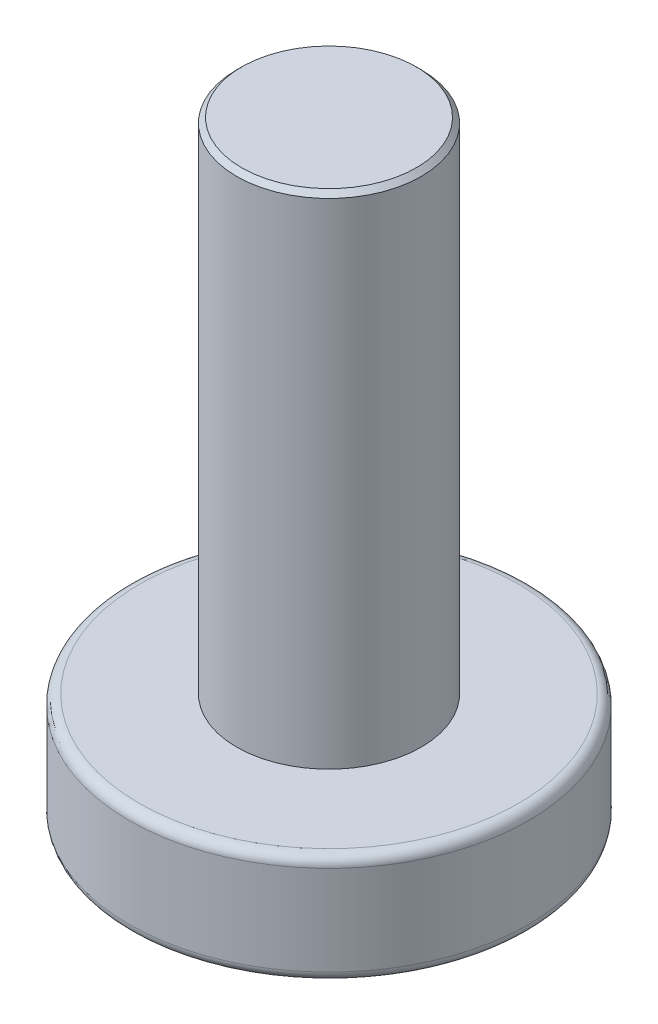
ISO-10303-21;
HEADER;
FILE_DESCRIPTION(('STEP AP214'),'2;1');
FILE_NAME('part.step','',(''),(''),'','','');
FILE_SCHEMA(('AUTOMOTIVE_DESIGN { 1 0 10303 214 1 1 1 1 }'));
ENDSEC;
DATA;
#1=APPLICATION_CONTEXT('core data for automotive mechanical design processes');
#2=APPLICATION_PROTOCOL_DEFINITION('international standard','automotive_design',2000,#1);
#3=PRODUCT_CONTEXT('',#1,'mechanical');
#4=PRODUCT('Part','Part','',(#3));
#5=PRODUCT_RELATED_PRODUCT_CATEGORY('part','',(#4));
#6=PRODUCT_DEFINITION_FORMATION('','',#4);
#7=PRODUCT_DEFINITION_CONTEXT('part definition',#1,'design');
#8=PRODUCT_DEFINITION('design','',#6,#7);
#9=PRODUCT_DEFINITION_SHAPE('','',#8);
#10=(LENGTH_UNIT() NAMED_UNIT(*) SI_UNIT(.MILLI.,.METRE.));
#11=(NAMED_UNIT(*) PLANE_ANGLE_UNIT() SI_UNIT($,.RADIAN.));
#12=(NAMED_UNIT(*) SI_UNIT($,.STERADIAN.) SOLID_ANGLE_UNIT());
#13=UNCERTAINTY_MEASURE_WITH_UNIT(LENGTH_MEASURE(1.E-05),#10,'distance_accuracy_value','');
#14=(GEOMETRIC_REPRESENTATION_CONTEXT(3) GLOBAL_UNCERTAINTY_ASSIGNED_CONTEXT((#13)) GLOBAL_UNIT_ASSIGNED_CONTEXT((#10,
#11,#12)) REPRESENTATION_CONTEXT('',''));
#15=CARTESIAN_POINT('',(0.,0.,0.));
#16=DIRECTION('',(0.,0.,1.));
#17=DIRECTION('',(1.,0.,0.));
#18=AXIS2_PLACEMENT_3D('',#15,#16,#17);
#19=CARTESIAN_POINT('',(0.,2.2,0.));
#20=DIRECTION('',(0.,-1.,0.));
#21=DIRECTION('',(0.,0.,-1.));
#22=AXIS2_PLACEMENT_3D('',#19,#20,#21);
#23=CYLINDRICAL_SURFACE('',#22,4.);
#24=CARTESIAN_POINT('',(0.,2.,0.));
#25=DIRECTION('',(0.,1.,0.));
#26=DIRECTION('',(0.,0.,1.));
#27=AXIS2_PLACEMENT_3D('',#24,#25,#26);
#28=CIRCLE('',#27,4.);
#29=CARTESIAN_POINT('',(0.,2.,4.));
#30=VERTEX_POINT('',#29);
#31=EDGE_CURVE('E43',#30,#30,#28,.F.);
#32=ORIENTED_EDGE('',*,*,#31,.T.);
#33=EDGE_LOOP('',(#32));
#34=FACE_BOUND('',#33,.T.);
#35=CARTESIAN_POINT('',(0.,0.2,0.));
#36=DIRECTION('',(0.,1.,0.));
#37=DIRECTION('',(0.,0.,1.));
#38=AXIS2_PLACEMENT_3D('',#35,#36,#37);
#39=CIRCLE('',#38,4.);
#40=CARTESIAN_POINT('',(0.,0.2,4.));
#41=VERTEX_POINT('',#40);
#42=EDGE_CURVE('E220',#41,#41,#39,.T.);
#43=ORIENTED_EDGE('',*,*,#42,.T.);
#44=EDGE_LOOP('',(#43));
#45=FACE_BOUND('',#44,.T.);
#46=ADVANCED_FACE('F35',(#34,#45),#23,.T.);
#47=CARTESIAN_POINT('',(0.,2.2,0.));
#48=DIRECTION('',(0.,1.,0.));
#49=DIRECTION('',(0.,0.,1.));
#50=AXIS2_PLACEMENT_3D('',#47,#48,#49);
#51=PLANE('',#50);
#52=CARTESIAN_POINT('',(0.,2.2,0.));
#53=DIRECTION('',(0.,1.,0.));
#54=DIRECTION('',(0.,0.,1.));
#55=AXIS2_PLACEMENT_3D('',#52,#53,#54);
#56=CIRCLE('',#55,3.8);
#57=CARTESIAN_POINT('',(0.,2.2,3.8));
#58=VERTEX_POINT('',#57);
#59=EDGE_CURVE('E217',#58,#58,#56,.T.);
#60=ORIENTED_EDGE('',*,*,#59,.T.);
#61=EDGE_LOOP('',(#60));
#62=FACE_BOUND('',#61,.T.);
#63=CARTESIAN_POINT('',(0.,2.2,0.));
#64=DIRECTION('',(0.,1.,0.));
#65=DIRECTION('',(0.,0.,1.));
#66=AXIS2_PLACEMENT_3D('',#63,#64,#65);
#67=CIRCLE('',#66,1.85);
#68=CARTESIAN_POINT('',(0.,2.2,1.85));
#69=VERTEX_POINT('',#68);
#70=EDGE_CURVE('E191',#69,#69,#67,.T.);
#71=ORIENTED_EDGE('',*,*,#70,.F.);
#72=EDGE_LOOP('',(#71));
#73=FACE_BOUND('',#72,.T.);
#74=ADVANCED_FACE('F233',(#62,#73),#51,.T.);
#75=CARTESIAN_POINT('',(0.,0.,0.));
#76=DIRECTION('',(0.,1.,0.));
#77=DIRECTION('',(0.,0.,1.));
#78=AXIS2_PLACEMENT_3D('',#75,#76,#77);
#79=PLANE('',#78);
#80=DIRECTION('',(0.,0.,-1.));
#81=VECTOR('',#80,1.);
#82=CARTESIAN_POINT('',(-2.,0.,-0.5));
#83=LINE('',#82,#81);
#84=CARTESIAN_POINT('',(-2.,0.,0.5));
#85=VERTEX_POINT('',#84);
#86=CARTESIAN_POINT('',(-2.,0.,-0.5));
#87=VERTEX_POINT('',#86);
#88=EDGE_CURVE('E160',#85,#87,#83,.T.);
#89=ORIENTED_EDGE('',*,*,#88,.F.);
#90=DIRECTION('',(-1.,0.,0.));
#91=VECTOR('',#90,1.);
#92=CARTESIAN_POINT('',(-2.,0.,0.5));
#93=LINE('',#92,#91);
#94=CARTESIAN_POINT('',(-0.5,0.,0.5));
#95=VERTEX_POINT('',#94);
#96=EDGE_CURVE('E50',#95,#85,#93,.T.);
#97=ORIENTED_EDGE('',*,*,#96,.F.);
#98=DIRECTION('',(0.,0.,-1.));
#99=VECTOR('',#98,1.);
#100=CARTESIAN_POINT('',(-0.5,0.,0.5));
#101=LINE('',#100,#99);
#102=CARTESIAN_POINT('',(-0.5,0.,2.));
#103=VERTEX_POINT('',#102);
#104=EDGE_CURVE('E187',#103,#95,#101,.T.);
#105=ORIENTED_EDGE('',*,*,#104,.F.);
#106=DIRECTION('',(-1.,0.,0.));
#107=VECTOR('',#106,1.);
#108=CARTESIAN_POINT('',(-0.5,0.,2.));
#109=LINE('',#108,#107);
#110=CARTESIAN_POINT('',(0.5,0.,2.));
#111=VERTEX_POINT('',#110);
#112=EDGE_CURVE('E185',#111,#103,#109,.T.);
#113=ORIENTED_EDGE('',*,*,#112,.F.);
#114=DIRECTION('',(0.,0.,1.));
#115=VECTOR('',#114,1.);
#116=CARTESIAN_POINT('',(0.5,0.,2.));
#117=LINE('',#116,#115);
#118=CARTESIAN_POINT('',(0.5,0.,0.5));
#119=VERTEX_POINT('',#118);
#120=EDGE_CURVE('E134',#119,#111,#117,.T.);
#121=ORIENTED_EDGE('',*,*,#120,.F.);
#122=DIRECTION('',(-1.,0.,0.));
#123=VECTOR('',#122,1.);
#124=CARTESIAN_POINT('',(0.5,0.,0.5));
#125=LINE('',#124,#123);
#126=CARTESIAN_POINT('',(2.,0.,0.5));
#127=VERTEX_POINT('',#126);
#128=EDGE_CURVE('E181',#127,#119,#125,.T.);
#129=ORIENTED_EDGE('',*,*,#128,.F.);
#130=DIRECTION('',(0.,0.,1.));
#131=VECTOR('',#130,1.);
#132=CARTESIAN_POINT('',(2.,0.,0.5));
#133=LINE('',#132,#131);
#134=CARTESIAN_POINT('',(2.,0.,-0.5));
#135=VERTEX_POINT('',#134);
#136=EDGE_CURVE('E178',#135,#127,#133,.T.);
#137=ORIENTED_EDGE('',*,*,#136,.F.);
#138=DIRECTION('',(1.,0.,0.));
#139=VECTOR('',#138,1.);
#140=CARTESIAN_POINT('',(2.,0.,-0.5));
#141=LINE('',#140,#139);
#142=CARTESIAN_POINT('',(0.5,0.,-0.5));
#143=VERTEX_POINT('',#142);
#144=EDGE_CURVE('E175',#143,#135,#141,.T.);
#145=ORIENTED_EDGE('',*,*,#144,.F.);
#146=DIRECTION('',(0.,0.,1.));
#147=VECTOR('',#146,1.);
#148=CARTESIAN_POINT('',(0.5,0.,-0.5));
#149=LINE('',#148,#147);
#150=CARTESIAN_POINT('',(0.5,0.,-2.));
#151=VERTEX_POINT('',#150);
#152=EDGE_CURVE('E172',#151,#143,#149,.T.);
#153=ORIENTED_EDGE('',*,*,#152,.F.);
#154=DIRECTION('',(1.,0.,0.));
#155=VECTOR('',#154,1.);
#156=CARTESIAN_POINT('',(0.5,0.,-2.));
#157=LINE('',#156,#155);
#158=CARTESIAN_POINT('',(-0.5,0.,-2.));
#159=VERTEX_POINT('',#158);
#160=EDGE_CURVE('E169',#159,#151,#157,.T.);
#161=ORIENTED_EDGE('',*,*,#160,.F.);
#162=DIRECTION('',(0.,0.,-1.));
#163=VECTOR('',#162,1.);
#164=CARTESIAN_POINT('',(-0.5,0.,-2.));
#165=LINE('',#164,#163);
#166=CARTESIAN_POINT('',(-0.5,0.,-0.5));
#167=VERTEX_POINT('',#166);
#168=EDGE_CURVE('E166',#167,#159,#165,.T.);
#169=ORIENTED_EDGE('',*,*,#168,.F.);
#170=DIRECTION('',(1.,0.,0.));
#171=VECTOR('',#170,1.);
#172=CARTESIAN_POINT('',(-0.5,0.,-0.5));
#173=LINE('',#172,#171);
#174=EDGE_CURVE('E163',#87,#167,#173,.T.);
#175=ORIENTED_EDGE('',*,*,#174,.F.);
#176=EDGE_LOOP('',(#89,#97,#105,#113,#121,#129,#137,#145,#153,#161,#169,#175));
#177=FACE_BOUND('',#176,.T.);
#178=CARTESIAN_POINT('',(0.,0.,0.));
#179=DIRECTION('',(0.,1.,0.));
#180=DIRECTION('',(0.,0.,1.));
#181=AXIS2_PLACEMENT_3D('',#178,#179,#180);
#182=CIRCLE('',#181,3.8);
#183=CARTESIAN_POINT('',(0.,0.,3.8));
#184=VERTEX_POINT('',#183);
#185=EDGE_CURVE('E11',#184,#184,#182,.F.);
#186=ORIENTED_EDGE('',*,*,#185,.T.);
#187=EDGE_LOOP('',(#186));
#188=FACE_BOUND('',#187,.T.);
#189=ADVANCED_FACE('F236',(#177,#188),#79,.F.);
#190=CARTESIAN_POINT('',(0.,12.2,0.));
#191=DIRECTION('',(0.,-1.,0.));
#192=DIRECTION('',(0.,0.,-1.));
#193=AXIS2_PLACEMENT_3D('',#190,#191,#192);
#194=CYLINDRICAL_SURFACE('',#193,1.85);
#195=CARTESIAN_POINT('',(0.,12.1,0.));
#196=DIRECTION('',(0.,1.,0.));
#197=DIRECTION('',(0.,0.,1.));
#198=AXIS2_PLACEMENT_3D('',#195,#196,#197);
#199=CIRCLE('',#198,1.85);
#200=CARTESIAN_POINT('',(0.,12.1,1.85));
#201=VERTEX_POINT('',#200);
#202=EDGE_CURVE('E214',#201,#201,#199,.F.);
#203=ORIENTED_EDGE('',*,*,#202,.T.);
#204=EDGE_LOOP('',(#203));
#205=FACE_BOUND('',#204,.T.);
#206=ORIENTED_EDGE('',*,*,#70,.T.);
#207=EDGE_LOOP('',(#206));
#208=FACE_BOUND('',#207,.T.);
#209=ADVANCED_FACE('F240',(#205,#208),#194,.T.);
#210=CARTESIAN_POINT('',(0.,12.2,0.));
#211=DIRECTION('',(0.,1.,0.));
#212=DIRECTION('',(0.,0.,1.));
#213=AXIS2_PLACEMENT_3D('',#210,#211,#212);
#214=PLANE('',#213);
#215=CARTESIAN_POINT('',(0.,12.2,0.));
#216=DIRECTION('',(0.,1.,0.));
#217=DIRECTION('',(0.,0.,1.));
#218=AXIS2_PLACEMENT_3D('',#215,#216,#217);
#219=CIRCLE('',#218,1.75);
#220=CARTESIAN_POINT('',(0.,12.2,1.75));
#221=VERTEX_POINT('',#220);
#222=EDGE_CURVE('E211',#221,#221,#219,.T.);
#223=ORIENTED_EDGE('',*,*,#222,.T.);
#224=EDGE_LOOP('',(#223));
#225=FACE_BOUND('',#224,.T.);
#226=ADVANCED_FACE('F242',(#225),#214,.T.);
#227=CARTESIAN_POINT('',(0.,12.2,0.));
#228=DIRECTION('',(0.,-1.,0.));
#229=DIRECTION('',(0.,0.,-1.));
#230=AXIS2_PLACEMENT_3D('',#227,#228,#229);
#231=CONICAL_SURFACE('',#230,1.75,0.785398163397453);
#232=ORIENTED_EDGE('',*,*,#202,.F.);
#233=EDGE_LOOP('',(#232));
#234=FACE_BOUND('',#233,.T.);
#235=ORIENTED_EDGE('',*,*,#222,.F.);
#236=EDGE_LOOP('',(#235));
#237=FACE_BOUND('',#236,.T.);
#238=ADVANCED_FACE('F230',(#234,#237),#231,.T.);
#239=CARTESIAN_POINT('',(0.,2.,0.));
#240=DIRECTION('',(0.,1.,0.));
#241=DIRECTION('',(0.,0.,1.));
#242=AXIS2_PLACEMENT_3D('',#239,#240,#241);
#243=TOROIDAL_SURFACE('',#242,3.8,0.2);
#244=ORIENTED_EDGE('',*,*,#31,.F.);
#245=EDGE_LOOP('',(#244));
#246=FACE_BOUND('',#245,.T.);
#247=ORIENTED_EDGE('',*,*,#59,.F.);
#248=EDGE_LOOP('',(#247));
#249=FACE_BOUND('',#248,.T.);
#250=ADVANCED_FACE('F227',(#246,#249),#243,.T.);
#251=CARTESIAN_POINT('',(0.,0.2,0.));
#252=DIRECTION('',(0.,1.,0.));
#253=DIRECTION('',(0.,0.,1.));
#254=AXIS2_PLACEMENT_3D('',#251,#252,#253);
#255=TOROIDAL_SURFACE('',#254,3.8,0.2);
#256=ORIENTED_EDGE('',*,*,#185,.F.);
#257=EDGE_LOOP('',(#256));
#258=FACE_BOUND('',#257,.T.);
#259=ORIENTED_EDGE('',*,*,#42,.F.);
#260=EDGE_LOOP('',(#259));
#261=FACE_BOUND('',#260,.T.);
#262=ADVANCED_FACE('F37',(#258,#261),#255,.T.);
#263=CARTESIAN_POINT('',(-2.,1.5,0.5));
#264=DIRECTION('',(0.,0.,1.));
#265=DIRECTION('',(1.,0.,0.));
#266=AXIS2_PLACEMENT_3D('',#263,#264,#265);
#267=PLANE('',#266);
#268=ORIENTED_EDGE('',*,*,#96,.T.);
#269=DIRECTION('',(0.,-1.,0.));
#270=VECTOR('',#269,1.);
#271=CARTESIAN_POINT('',(-2.,1.5,0.5));
#272=LINE('',#271,#270);
#273=CARTESIAN_POINT('',(-2.,1.5,0.5));
#274=VERTEX_POINT('',#273);
#275=EDGE_CURVE('E98',#274,#85,#272,.T.);
#276=ORIENTED_EDGE('',*,*,#275,.F.);
#277=DIRECTION('',(-1.,0.,0.));
#278=VECTOR('',#277,1.);
#279=CARTESIAN_POINT('',(-2.,1.5,0.5));
#280=LINE('',#279,#278);
#281=CARTESIAN_POINT('',(-0.5,1.5,0.5));
#282=VERTEX_POINT('',#281);
#283=EDGE_CURVE('E189',#282,#274,#280,.T.);
#284=ORIENTED_EDGE('',*,*,#283,.F.);
#285=DIRECTION('',(0.,-1.,0.));
#286=VECTOR('',#285,1.);
#287=CARTESIAN_POINT('',(-0.5,1.5,0.5));
#288=LINE('',#287,#286);
#289=EDGE_CURVE('E58',#282,#95,#288,.T.);
#290=ORIENTED_EDGE('',*,*,#289,.T.);
#291=EDGE_LOOP('',(#268,#276,#284,#290));
#292=FACE_BOUND('',#291,.T.);
#293=ADVANCED_FACE('F278',(#292),#267,.F.);
#294=CARTESIAN_POINT('',(-0.5,1.5,0.5));
#295=DIRECTION('',(-1.,0.,0.));
#296=DIRECTION('',(0.,0.,1.));
#297=AXIS2_PLACEMENT_3D('',#294,#295,#296);
#298=PLANE('',#297);
#299=ORIENTED_EDGE('',*,*,#104,.T.);
#300=ORIENTED_EDGE('',*,*,#289,.F.);
#301=DIRECTION('',(0.,0.,-1.));
#302=VECTOR('',#301,1.);
#303=CARTESIAN_POINT('',(-0.5,1.5,0.5));
#304=LINE('',#303,#302);
#305=CARTESIAN_POINT('',(-0.5,1.5,2.));
#306=VERTEX_POINT('',#305);
#307=EDGE_CURVE('E146',#306,#282,#304,.T.);
#308=ORIENTED_EDGE('',*,*,#307,.F.);
#309=DIRECTION('',(0.,-1.,0.));
#310=VECTOR('',#309,1.);
#311=CARTESIAN_POINT('',(-0.5,1.5,2.));
#312=LINE('',#311,#310);
#313=EDGE_CURVE('E138',#306,#103,#312,.T.);
#314=ORIENTED_EDGE('',*,*,#313,.T.);
#315=EDGE_LOOP('',(#299,#300,#308,#314));
#316=FACE_BOUND('',#315,.T.);
#317=ADVANCED_FACE('F286',(#316),#298,.F.);
#318=CARTESIAN_POINT('',(-0.5,1.5,2.));
#319=DIRECTION('',(0.,0.,1.));
#320=DIRECTION('',(1.,0.,0.));
#321=AXIS2_PLACEMENT_3D('',#318,#319,#320);
#322=PLANE('',#321);
#323=ORIENTED_EDGE('',*,*,#112,.T.);
#324=ORIENTED_EDGE('',*,*,#313,.F.);
#325=DIRECTION('',(-1.,0.,0.));
#326=VECTOR('',#325,1.);
#327=CARTESIAN_POINT('',(-0.5,1.5,2.));
#328=LINE('',#327,#326);
#329=CARTESIAN_POINT('',(0.5,1.5,2.));
#330=VERTEX_POINT('',#329);
#331=EDGE_CURVE('E142',#330,#306,#328,.T.);
#332=ORIENTED_EDGE('',*,*,#331,.F.);
#333=DIRECTION('',(0.,-1.,0.));
#334=VECTOR('',#333,1.);
#335=CARTESIAN_POINT('',(0.5,1.5,2.));
#336=LINE('',#335,#334);
#337=EDGE_CURVE('E127',#330,#111,#336,.T.);
#338=ORIENTED_EDGE('',*,*,#337,.T.);
#339=EDGE_LOOP('',(#323,#324,#332,#338));
#340=FACE_BOUND('',#339,.T.);
#341=ADVANCED_FACE('F143',(#340),#322,.F.);
#342=CARTESIAN_POINT('',(0.5,1.5,2.));
#343=DIRECTION('',(1.,0.,0.));
#344=DIRECTION('',(0.,0.,-1.));
#345=AXIS2_PLACEMENT_3D('',#342,#343,#344);
#346=PLANE('',#345);
#347=ORIENTED_EDGE('',*,*,#120,.T.);
#348=ORIENTED_EDGE('',*,*,#337,.F.);
#349=DIRECTION('',(0.,0.,1.));
#350=VECTOR('',#349,1.);
#351=CARTESIAN_POINT('',(0.5,1.5,2.));
#352=LINE('',#351,#350);
#353=CARTESIAN_POINT('',(0.5,1.5,0.5));
#354=VERTEX_POINT('',#353);
#355=EDGE_CURVE('E131',#354,#330,#352,.T.);
#356=ORIENTED_EDGE('',*,*,#355,.F.);
#357=DIRECTION('',(0.,-1.,0.));
#358=VECTOR('',#357,1.);
#359=CARTESIAN_POINT('',(0.5,1.5,0.5));
#360=LINE('',#359,#358);
#361=EDGE_CURVE('E139',#354,#119,#360,.T.);
#362=ORIENTED_EDGE('',*,*,#361,.T.);
#363=EDGE_LOOP('',(#347,#348,#356,#362));
#364=FACE_BOUND('',#363,.T.);
#365=ADVANCED_FACE('F129',(#364),#346,.F.);
#366=CARTESIAN_POINT('',(0.5,1.5,0.5));
#367=DIRECTION('',(0.,0.,1.));
#368=DIRECTION('',(1.,0.,0.));
#369=AXIS2_PLACEMENT_3D('',#366,#367,#368);
#370=PLANE('',#369);
#371=ORIENTED_EDGE('',*,*,#128,.T.);
#372=ORIENTED_EDGE('',*,*,#361,.F.);
#373=DIRECTION('',(-1.,0.,0.));
#374=VECTOR('',#373,1.);
#375=CARTESIAN_POINT('',(0.5,1.5,0.5));
#376=LINE('',#375,#374);
#377=CARTESIAN_POINT('',(2.,1.5,0.5));
#378=VERTEX_POINT('',#377);
#379=EDGE_CURVE('E152',#378,#354,#376,.T.);
#380=ORIENTED_EDGE('',*,*,#379,.F.);
#381=DIRECTION('',(0.,-1.,0.));
#382=VECTOR('',#381,1.);
#383=CARTESIAN_POINT('',(2.,1.5,0.5));
#384=LINE('',#383,#382);
#385=EDGE_CURVE('E194',#378,#127,#384,.T.);
#386=ORIENTED_EDGE('',*,*,#385,.T.);
#387=EDGE_LOOP('',(#371,#372,#380,#386));
#388=FACE_BOUND('',#387,.T.);
#389=ADVANCED_FACE('F305',(#388),#370,.F.);
#390=CARTESIAN_POINT('',(2.,1.5,0.5));
#391=DIRECTION('',(1.,0.,0.));
#392=DIRECTION('',(0.,0.,-1.));
#393=AXIS2_PLACEMENT_3D('',#390,#391,#392);
#394=PLANE('',#393);
#395=ORIENTED_EDGE('',*,*,#136,.T.);
#396=ORIENTED_EDGE('',*,*,#385,.F.);
#397=DIRECTION('',(0.,0.,1.));
#398=VECTOR('',#397,1.);
#399=CARTESIAN_POINT('',(2.,1.5,0.5));
#400=LINE('',#399,#398);
#401=CARTESIAN_POINT('',(2.,1.5,-0.5));
#402=VERTEX_POINT('',#401);
#403=EDGE_CURVE('E154',#402,#378,#400,.T.);
#404=ORIENTED_EDGE('',*,*,#403,.F.);
#405=DIRECTION('',(0.,-1.,0.));
#406=VECTOR('',#405,1.);
#407=CARTESIAN_POINT('',(2.,1.5,-0.5));
#408=LINE('',#407,#406);
#409=EDGE_CURVE('E196',#402,#135,#408,.T.);
#410=ORIENTED_EDGE('',*,*,#409,.T.);
#411=EDGE_LOOP('',(#395,#396,#404,#410));
#412=FACE_BOUND('',#411,.T.);
#413=ADVANCED_FACE('F312',(#412),#394,.F.);
#414=CARTESIAN_POINT('',(2.,1.5,-0.5));
#415=DIRECTION('',(0.,0.,-1.));
#416=DIRECTION('',(-1.,0.,0.));
#417=AXIS2_PLACEMENT_3D('',#414,#415,#416);
#418=PLANE('',#417);
#419=ORIENTED_EDGE('',*,*,#144,.T.);
#420=ORIENTED_EDGE('',*,*,#409,.F.);
#421=DIRECTION('',(1.,0.,0.));
#422=VECTOR('',#421,1.);
#423=CARTESIAN_POINT('',(2.,1.5,-0.5));
#424=LINE('',#423,#422);
#425=CARTESIAN_POINT('',(0.5,1.5,-0.5));
#426=VERTEX_POINT('',#425);
#427=EDGE_CURVE('E455',#426,#402,#424,.T.);
#428=ORIENTED_EDGE('',*,*,#427,.F.);
#429=DIRECTION('',(0.,-1.,0.));
#430=VECTOR('',#429,1.);
#431=CARTESIAN_POINT('',(0.5,1.5,-0.5));
#432=LINE('',#431,#430);
#433=EDGE_CURVE('E198',#426,#143,#432,.T.);
#434=ORIENTED_EDGE('',*,*,#433,.T.);
#435=EDGE_LOOP('',(#419,#420,#428,#434));
#436=FACE_BOUND('',#435,.T.);
#437=ADVANCED_FACE('F320',(#436),#418,.F.);
#438=CARTESIAN_POINT('',(0.5,1.5,-0.5));
#439=DIRECTION('',(1.,0.,0.));
#440=DIRECTION('',(0.,0.,-1.));
#441=AXIS2_PLACEMENT_3D('',#438,#439,#440);
#442=PLANE('',#441);
#443=ORIENTED_EDGE('',*,*,#152,.T.);
#444=ORIENTED_EDGE('',*,*,#433,.F.);
#445=DIRECTION('',(0.,0.,1.));
#446=VECTOR('',#445,1.);
#447=CARTESIAN_POINT('',(0.5,1.5,-0.5));
#448=LINE('',#447,#446);
#449=CARTESIAN_POINT('',(0.5,1.5,-2.));
#450=VERTEX_POINT('',#449);
#451=EDGE_CURVE('E452',#450,#426,#448,.T.);
#452=ORIENTED_EDGE('',*,*,#451,.F.);
#453=DIRECTION('',(0.,-1.,0.));
#454=VECTOR('',#453,1.);
#455=CARTESIAN_POINT('',(0.5,1.5,-2.));
#456=LINE('',#455,#454);
#457=EDGE_CURVE('E200',#450,#151,#456,.T.);
#458=ORIENTED_EDGE('',*,*,#457,.T.);
#459=EDGE_LOOP('',(#443,#444,#452,#458));
#460=FACE_BOUND('',#459,.T.);
#461=ADVANCED_FACE('F328',(#460),#442,.F.);
#462=CARTESIAN_POINT('',(0.5,1.5,-2.));
#463=DIRECTION('',(0.,0.,-1.));
#464=DIRECTION('',(-1.,0.,0.));
#465=AXIS2_PLACEMENT_3D('',#462,#463,#464);
#466=PLANE('',#465);
#467=ORIENTED_EDGE('',*,*,#160,.T.);
#468=ORIENTED_EDGE('',*,*,#457,.F.);
#469=DIRECTION('',(1.,0.,0.));
#470=VECTOR('',#469,1.);
#471=CARTESIAN_POINT('',(0.5,1.5,-2.));
#472=LINE('',#471,#470);
#473=CARTESIAN_POINT('',(-0.5,1.5,-2.));
#474=VERTEX_POINT('',#473);
#475=EDGE_CURVE('E449',#474,#450,#472,.T.);
#476=ORIENTED_EDGE('',*,*,#475,.F.);
#477=DIRECTION('',(0.,-1.,0.));
#478=VECTOR('',#477,1.);
#479=CARTESIAN_POINT('',(-0.5,1.5,-2.));
#480=LINE('',#479,#478);
#481=EDGE_CURVE('E202',#474,#159,#480,.T.);
#482=ORIENTED_EDGE('',*,*,#481,.T.);
#483=EDGE_LOOP('',(#467,#468,#476,#482));
#484=FACE_BOUND('',#483,.T.);
#485=ADVANCED_FACE('F336',(#484),#466,.F.);
#486=CARTESIAN_POINT('',(-0.5,1.5,-2.));
#487=DIRECTION('',(-1.,0.,0.));
#488=DIRECTION('',(0.,0.,1.));
#489=AXIS2_PLACEMENT_3D('',#486,#487,#488);
#490=PLANE('',#489);
#491=ORIENTED_EDGE('',*,*,#168,.T.);
#492=ORIENTED_EDGE('',*,*,#481,.F.);
#493=DIRECTION('',(0.,0.,-1.));
#494=VECTOR('',#493,1.);
#495=CARTESIAN_POINT('',(-0.5,1.5,-2.));
#496=LINE('',#495,#494);
#497=CARTESIAN_POINT('',(-0.5,1.5,-0.5));
#498=VERTEX_POINT('',#497);
#499=EDGE_CURVE('E442',#498,#474,#496,.T.);
#500=ORIENTED_EDGE('',*,*,#499,.F.);
#501=DIRECTION('',(0.,-1.,0.));
#502=VECTOR('',#501,1.);
#503=CARTESIAN_POINT('',(-0.5,1.5,-0.5));
#504=LINE('',#503,#502);
#505=EDGE_CURVE('E204',#498,#167,#504,.T.);
#506=ORIENTED_EDGE('',*,*,#505,.T.);
#507=EDGE_LOOP('',(#491,#492,#500,#506));
#508=FACE_BOUND('',#507,.T.);
#509=ADVANCED_FACE('F344',(#508),#490,.F.);
#510=CARTESIAN_POINT('',(-0.5,1.5,-0.5));
#511=DIRECTION('',(0.,0.,-1.));
#512=DIRECTION('',(-1.,0.,0.));
#513=AXIS2_PLACEMENT_3D('',#510,#511,#512);
#514=PLANE('',#513);
#515=ORIENTED_EDGE('',*,*,#174,.T.);
#516=ORIENTED_EDGE('',*,*,#505,.F.);
#517=DIRECTION('',(1.,0.,0.));
#518=VECTOR('',#517,1.);
#519=CARTESIAN_POINT('',(-0.5,1.5,-0.5));
#520=LINE('',#519,#518);
#521=CARTESIAN_POINT('',(-2.,1.5,-0.5));
#522=VERTEX_POINT('',#521);
#523=EDGE_CURVE('E439',#522,#498,#520,.T.);
#524=ORIENTED_EDGE('',*,*,#523,.F.);
#525=DIRECTION('',(0.,-1.,0.));
#526=VECTOR('',#525,1.);
#527=CARTESIAN_POINT('',(-2.,1.5,-0.5));
#528=LINE('',#527,#526);
#529=EDGE_CURVE('E206',#522,#87,#528,.T.);
#530=ORIENTED_EDGE('',*,*,#529,.T.);
#531=EDGE_LOOP('',(#515,#516,#524,#530));
#532=FACE_BOUND('',#531,.T.);
#533=ADVANCED_FACE('F352',(#532),#514,.F.);
#534=CARTESIAN_POINT('',(-2.,1.5,-0.5));
#535=DIRECTION('',(-1.,0.,0.));
#536=DIRECTION('',(0.,0.,1.));
#537=AXIS2_PLACEMENT_3D('',#534,#535,#536);
#538=PLANE('',#537);
#539=ORIENTED_EDGE('',*,*,#88,.T.);
#540=ORIENTED_EDGE('',*,*,#529,.F.);
#541=DIRECTION('',(0.,0.,-1.));
#542=VECTOR('',#541,1.);
#543=CARTESIAN_POINT('',(-2.,1.5,-0.5));
#544=LINE('',#543,#542);
#545=EDGE_CURVE('E443',#274,#522,#544,.T.);
#546=ORIENTED_EDGE('',*,*,#545,.F.);
#547=ORIENTED_EDGE('',*,*,#275,.T.);
#548=EDGE_LOOP('',(#539,#540,#546,#547));
#549=FACE_BOUND('',#548,.T.);
#550=ADVANCED_FACE('F360',(#549),#538,.F.);
#551=CARTESIAN_POINT('',(0.,1.5,0.));
#552=DIRECTION('',(0.,-1.,0.));
#553=DIRECTION('',(0.,0.,-1.));
#554=AXIS2_PLACEMENT_3D('',#551,#552,#553);
#555=PLANE('',#554);
#556=ORIENTED_EDGE('',*,*,#283,.T.);
#557=ORIENTED_EDGE('',*,*,#545,.T.);
#558=ORIENTED_EDGE('',*,*,#523,.T.);
#559=ORIENTED_EDGE('',*,*,#499,.T.);
#560=ORIENTED_EDGE('',*,*,#475,.T.);
#561=ORIENTED_EDGE('',*,*,#451,.T.);
#562=ORIENTED_EDGE('',*,*,#427,.T.);
#563=ORIENTED_EDGE('',*,*,#403,.T.);
#564=ORIENTED_EDGE('',*,*,#379,.T.);
#565=ORIENTED_EDGE('',*,*,#355,.T.);
#566=ORIENTED_EDGE('',*,*,#331,.T.);
#567=ORIENTED_EDGE('',*,*,#307,.T.);
#568=EDGE_LOOP('',(#556,#557,#558,#559,#560,#561,#562,#563,#564,#565,#566,#567));
#569=FACE_BOUND('',#568,.T.);
#570=ADVANCED_FACE('F149',(#569),#555,.T.);
#571=CLOSED_SHELL('',(#46,#74,#189,#209,#226,#238,#250,#262,#293,#317,#341,#365,#389,#413,#437,
#461,#485,#509,#533,#550,#570));
#572=MANIFOLD_SOLID_BREP('B2',#571);
#573=ADVANCED_BREP_SHAPE_REPRESENTATION('',(#18,#572),#14);
#574=SHAPE_DEFINITION_REPRESENTATION(#9,#573);
ENDSEC;
END-ISO-10303-21;
